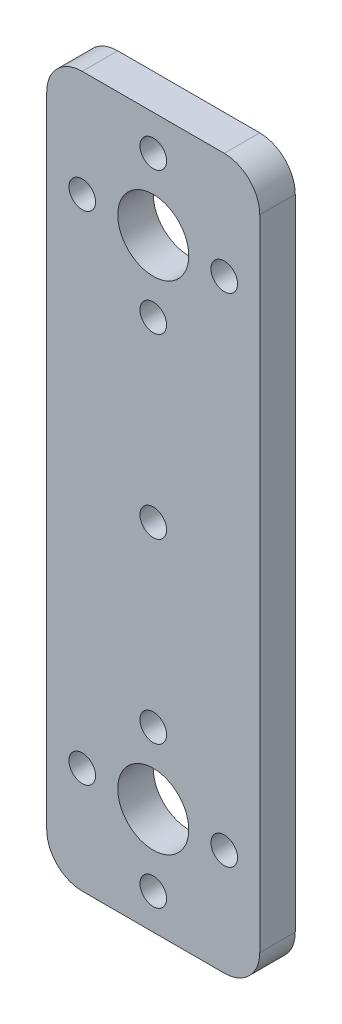
ISO-10303-21;
HEADER;
FILE_DESCRIPTION(('STEP AP214'),'2;1');
FILE_NAME('part.step','',(''),(''),'','','');
FILE_SCHEMA(('AUTOMOTIVE_DESIGN { 1 0 10303 214 1 1 1 1 }'));
ENDSEC;
DATA;
#1=APPLICATION_CONTEXT('core data for automotive mechanical design processes');
#2=APPLICATION_PROTOCOL_DEFINITION('international standard','automotive_design',2000,#1);
#3=PRODUCT_CONTEXT('',#1,'mechanical');
#4=PRODUCT('Part','Part','',(#3));
#5=PRODUCT_RELATED_PRODUCT_CATEGORY('part','',(#4));
#6=PRODUCT_DEFINITION_FORMATION('','',#4);
#7=PRODUCT_DEFINITION_CONTEXT('part definition',#1,'design');
#8=PRODUCT_DEFINITION('design','',#6,#7);
#9=PRODUCT_DEFINITION_SHAPE('','',#8);
#10=(LENGTH_UNIT() NAMED_UNIT(*) SI_UNIT(.MILLI.,.METRE.));
#11=(NAMED_UNIT(*) PLANE_ANGLE_UNIT() SI_UNIT($,.RADIAN.));
#12=(NAMED_UNIT(*) SI_UNIT($,.STERADIAN.) SOLID_ANGLE_UNIT());
#13=UNCERTAINTY_MEASURE_WITH_UNIT(LENGTH_MEASURE(1.E-05),#10,'distance_accuracy_value','');
#14=(GEOMETRIC_REPRESENTATION_CONTEXT(3) GLOBAL_UNCERTAINTY_ASSIGNED_CONTEXT((#13)) GLOBAL_UNIT_ASSIGNED_CONTEXT((#10,
#11,#12)) REPRESENTATION_CONTEXT('',''));
#15=CARTESIAN_POINT('',(0.,0.,0.));
#16=DIRECTION('',(0.,0.,1.));
#17=DIRECTION('',(1.,0.,0.));
#18=AXIS2_PLACEMENT_3D('',#15,#16,#17);
#19=CARTESIAN_POINT('',(-57.2966754660947,34.9503189792664,4.));
#20=DIRECTION('',(0.,1.,0.));
#21=DIRECTION('',(0.,0.,1.));
#22=AXIS2_PLACEMENT_3D('',#19,#20,#21);
#23=PLANE('',#22);
#24=DIRECTION('',(1.,0.,0.));
#25=VECTOR('',#24,1.);
#26=CARTESIAN_POINT('',(-57.2966754660947,34.9503189792664,0.));
#27=LINE('',#26,#25);
#28=CARTESIAN_POINT('',(-53.2966754660947,34.9503189792664,0.));
#29=VERTEX_POINT('',#28);
#30=CARTESIAN_POINT('',(-37.2966754660947,34.9503189792664,0.));
#31=VERTEX_POINT('',#30);
#32=EDGE_CURVE('E129',#29,#31,#27,.T.);
#33=ORIENTED_EDGE('',*,*,#32,.F.);
#34=DIRECTION('',(0.,0.,-1.));
#35=VECTOR('',#34,1.);
#36=CARTESIAN_POINT('',(-53.2966754660947,34.9503189792664,4.));
#37=LINE('',#36,#35);
#38=CARTESIAN_POINT('',(-53.2966754660947,34.9503189792664,4.));
#39=VERTEX_POINT('',#38);
#40=EDGE_CURVE('E11',#29,#39,#37,.F.);
#41=ORIENTED_EDGE('',*,*,#40,.T.);
#42=DIRECTION('',(1.,0.,0.));
#43=VECTOR('',#42,1.);
#44=CARTESIAN_POINT('',(-57.2966754660947,34.9503189792664,4.));
#45=LINE('',#44,#43);
#46=CARTESIAN_POINT('',(-37.2966754660947,34.9503189792664,4.));
#47=VERTEX_POINT('',#46);
#48=EDGE_CURVE('E127',#39,#47,#45,.T.);
#49=ORIENTED_EDGE('',*,*,#48,.T.);
#50=DIRECTION('',(0.,0.,-1.));
#51=VECTOR('',#50,1.);
#52=CARTESIAN_POINT('',(-37.2966754660947,34.9503189792664,4.));
#53=LINE('',#52,#51);
#54=EDGE_CURVE('E41',#47,#31,#53,.T.);
#55=ORIENTED_EDGE('',*,*,#54,.T.);
#56=EDGE_LOOP('',(#33,#41,#49,#55));
#57=FACE_BOUND('',#56,.T.);
#58=ADVANCED_FACE('F33',(#57),#23,.T.);
#59=CARTESIAN_POINT('',(-57.2966754660947,34.9503189792664,4.));
#60=DIRECTION('',(1.,0.,0.));
#61=DIRECTION('',(0.,1.,0.));
#62=AXIS2_PLACEMENT_3D('',#59,#60,#61);
#63=PLANE('',#62);
#64=DIRECTION('',(0.,-1.,0.));
#65=VECTOR('',#64,1.);
#66=CARTESIAN_POINT('',(-57.2966754660947,34.9503189792664,0.));
#67=LINE('',#66,#65);
#68=CARTESIAN_POINT('',(-57.2966754660947,30.9503189792664,0.));
#69=VERTEX_POINT('',#68);
#70=CARTESIAN_POINT('',(-57.2966754660947,-41.0496810207336,0.));
#71=VERTEX_POINT('',#70);
#72=EDGE_CURVE('E124',#69,#71,#67,.T.);
#73=ORIENTED_EDGE('',*,*,#72,.T.);
#74=DIRECTION('',(0.,0.,-1.));
#75=VECTOR('',#74,1.);
#76=CARTESIAN_POINT('',(-57.2966754660947,-41.0496810207336,4.));
#77=LINE('',#76,#75);
#78=CARTESIAN_POINT('',(-57.2966754660947,-41.0496810207336,4.));
#79=VERTEX_POINT('',#78);
#80=EDGE_CURVE('E104',#71,#79,#77,.F.);
#81=ORIENTED_EDGE('',*,*,#80,.T.);
#82=DIRECTION('',(0.,-1.,0.));
#83=VECTOR('',#82,1.);
#84=CARTESIAN_POINT('',(-57.2966754660947,34.9503189792664,4.));
#85=LINE('',#84,#83);
#86=CARTESIAN_POINT('',(-57.2966754660947,30.9503189792664,4.));
#87=VERTEX_POINT('',#86);
#88=EDGE_CURVE('E133',#87,#79,#85,.T.);
#89=ORIENTED_EDGE('',*,*,#88,.F.);
#90=DIRECTION('',(0.,0.,-1.));
#91=VECTOR('',#90,1.);
#92=CARTESIAN_POINT('',(-57.2966754660947,30.9503189792664,0.));
#93=LINE('',#92,#91);
#94=EDGE_CURVE('E109',#87,#69,#93,.T.);
#95=ORIENTED_EDGE('',*,*,#94,.T.);
#96=EDGE_LOOP('',(#73,#81,#89,#95));
#97=FACE_BOUND('',#96,.T.);
#98=ADVANCED_FACE('F272',(#97),#63,.F.);
#99=CARTESIAN_POINT('',(-57.2966754660947,-45.0496810207336,4.));
#100=DIRECTION('',(0.,1.,0.));
#101=DIRECTION('',(0.,0.,1.));
#102=AXIS2_PLACEMENT_3D('',#99,#100,#101);
#103=PLANE('',#102);
#104=DIRECTION('',(1.,0.,0.));
#105=VECTOR('',#104,1.);
#106=CARTESIAN_POINT('',(-57.2966754660947,-45.0496810207336,4.));
#107=LINE('',#106,#105);
#108=CARTESIAN_POINT('',(-53.2966754660947,-45.0496810207336,4.));
#109=VERTEX_POINT('',#108);
#110=CARTESIAN_POINT('',(-37.2966754660947,-45.0496810207336,4.));
#111=VERTEX_POINT('',#110);
#112=EDGE_CURVE('E118',#109,#111,#107,.T.);
#113=ORIENTED_EDGE('',*,*,#112,.F.);
#114=DIRECTION('',(0.,0.,-1.));
#115=VECTOR('',#114,1.);
#116=CARTESIAN_POINT('',(-53.2966754660947,-45.0496810207336,4.));
#117=LINE('',#116,#115);
#118=CARTESIAN_POINT('',(-53.2966754660947,-45.0496810207336,0.));
#119=VERTEX_POINT('',#118);
#120=EDGE_CURVE('E103',#109,#119,#117,.T.);
#121=ORIENTED_EDGE('',*,*,#120,.T.);
#122=DIRECTION('',(1.,0.,0.));
#123=VECTOR('',#122,1.);
#124=CARTESIAN_POINT('',(-57.2966754660947,-45.0496810207336,0.));
#125=LINE('',#124,#123);
#126=CARTESIAN_POINT('',(-37.2966754660947,-45.0496810207336,0.));
#127=VERTEX_POINT('',#126);
#128=EDGE_CURVE('E116',#119,#127,#125,.T.);
#129=ORIENTED_EDGE('',*,*,#128,.T.);
#130=DIRECTION('',(0.,0.,-1.));
#131=VECTOR('',#130,1.);
#132=CARTESIAN_POINT('',(-37.2966754660947,-45.0496810207336,4.));
#133=LINE('',#132,#131);
#134=EDGE_CURVE('E120',#127,#111,#133,.F.);
#135=ORIENTED_EDGE('',*,*,#134,.T.);
#136=EDGE_LOOP('',(#113,#121,#129,#135));
#137=FACE_BOUND('',#136,.T.);
#138=ADVANCED_FACE('F115',(#137),#103,.F.);
#139=CARTESIAN_POINT('',(-33.2966754660947,34.9503189792664,4.));
#140=DIRECTION('',(1.,0.,0.));
#141=DIRECTION('',(0.,1.,0.));
#142=AXIS2_PLACEMENT_3D('',#139,#140,#141);
#143=PLANE('',#142);
#144=DIRECTION('',(0.,-1.,0.));
#145=VECTOR('',#144,1.);
#146=CARTESIAN_POINT('',(-33.2966754660947,34.9503189792664,4.));
#147=LINE('',#146,#145);
#148=CARTESIAN_POINT('',(-33.2966754660947,30.9503189792664,4.));
#149=VERTEX_POINT('',#148);
#150=CARTESIAN_POINT('',(-33.2966754660947,-41.0496810207336,4.));
#151=VERTEX_POINT('',#150);
#152=EDGE_CURVE('E170',#149,#151,#147,.T.);
#153=ORIENTED_EDGE('',*,*,#152,.T.);
#154=DIRECTION('',(0.,0.,-1.));
#155=VECTOR('',#154,1.);
#156=CARTESIAN_POINT('',(-33.2966754660947,-41.0496810207336,0.));
#157=LINE('',#156,#155);
#158=CARTESIAN_POINT('',(-33.2966754660947,-41.0496810207336,0.));
#159=VERTEX_POINT('',#158);
#160=EDGE_CURVE('E150',#151,#159,#157,.T.);
#161=ORIENTED_EDGE('',*,*,#160,.T.);
#162=DIRECTION('',(0.,-1.,0.));
#163=VECTOR('',#162,1.);
#164=CARTESIAN_POINT('',(-33.2966754660947,34.9503189792664,0.));
#165=LINE('',#164,#163);
#166=CARTESIAN_POINT('',(-33.2966754660947,30.9503189792664,0.));
#167=VERTEX_POINT('',#166);
#168=EDGE_CURVE('E125',#167,#159,#165,.T.);
#169=ORIENTED_EDGE('',*,*,#168,.F.);
#170=DIRECTION('',(0.,0.,-1.));
#171=VECTOR('',#170,1.);
#172=CARTESIAN_POINT('',(-33.2966754660947,30.9503189792664,4.));
#173=LINE('',#172,#171);
#174=EDGE_CURVE('E55',#167,#149,#173,.F.);
#175=ORIENTED_EDGE('',*,*,#174,.T.);
#176=EDGE_LOOP('',(#153,#161,#169,#175));
#177=FACE_BOUND('',#176,.T.);
#178=ADVANCED_FACE('F247',(#177),#143,.T.);
#179=CARTESIAN_POINT('',(0.,0.,4.));
#180=DIRECTION('',(0.,0.,-1.));
#181=DIRECTION('',(-1.,0.,0.));
#182=AXIS2_PLACEMENT_3D('',#179,#180,#181);
#183=PLANE('',#182);
#184=CARTESIAN_POINT('',(-45.2966754660948,-5.04968102073364,4.));
#185=DIRECTION('',(0.,0.,1.));
#186=DIRECTION('',(1.,0.,0.));
#187=AXIS2_PLACEMENT_3D('',#184,#185,#186);
#188=CIRCLE('',#187,1.5);
#189=CARTESIAN_POINT('',(-43.7966754660948,-5.04968102073364,4.));
#190=VERTEX_POINT('',#189);
#191=EDGE_CURVE('E230',#190,#190,#188,.T.);
#192=ORIENTED_EDGE('',*,*,#191,.F.);
#193=EDGE_LOOP('',(#192));
#194=FACE_BOUND('',#193,.T.);
#195=CARTESIAN_POINT('',(-45.2966754660948,14.9503189792664,4.));
#196=DIRECTION('',(0.,0.,1.));
#197=DIRECTION('',(1.,0.,0.));
#198=AXIS2_PLACEMENT_3D('',#195,#196,#197);
#199=CIRCLE('',#198,1.5);
#200=CARTESIAN_POINT('',(-43.7966754660948,14.9503189792664,4.));
#201=VERTEX_POINT('',#200);
#202=EDGE_CURVE('E221',#201,#201,#199,.T.);
#203=ORIENTED_EDGE('',*,*,#202,.F.);
#204=EDGE_LOOP('',(#203));
#205=FACE_BOUND('',#204,.T.);
#206=CARTESIAN_POINT('',(-37.2966754660949,22.9503189792664,4.));
#207=DIRECTION('',(0.,0.,1.));
#208=DIRECTION('',(1.,0.,0.));
#209=AXIS2_PLACEMENT_3D('',#206,#207,#208);
#210=CIRCLE('',#209,1.5);
#211=CARTESIAN_POINT('',(-35.7966754660949,22.9503189792664,4.));
#212=VERTEX_POINT('',#211);
#213=EDGE_CURVE('E215',#212,#212,#210,.T.);
#214=ORIENTED_EDGE('',*,*,#213,.F.);
#215=EDGE_LOOP('',(#214));
#216=FACE_BOUND('',#215,.T.);
#217=CARTESIAN_POINT('',(-45.2966754660949,22.9503189792664,4.));
#218=DIRECTION('',(0.,0.,1.));
#219=DIRECTION('',(1.,0.,0.));
#220=AXIS2_PLACEMENT_3D('',#217,#218,#219);
#221=CIRCLE('',#220,4.);
#222=CARTESIAN_POINT('',(-41.2966754660949,22.9503189792664,4.));
#223=VERTEX_POINT('',#222);
#224=EDGE_CURVE('E209',#223,#223,#221,.T.);
#225=ORIENTED_EDGE('',*,*,#224,.F.);
#226=EDGE_LOOP('',(#225));
#227=FACE_BOUND('',#226,.T.);
#228=CARTESIAN_POINT('',(-45.2966754660949,30.9503189792664,4.));
#229=DIRECTION('',(0.,0.,1.));
#230=DIRECTION('',(1.,0.,0.));
#231=AXIS2_PLACEMENT_3D('',#228,#229,#230);
#232=CIRCLE('',#231,1.5);
#233=CARTESIAN_POINT('',(-43.7966754660949,30.9503189792664,4.));
#234=VERTEX_POINT('',#233);
#235=EDGE_CURVE('E203',#234,#234,#232,.T.);
#236=ORIENTED_EDGE('',*,*,#235,.F.);
#237=EDGE_LOOP('',(#236));
#238=FACE_BOUND('',#237,.T.);
#239=CARTESIAN_POINT('',(-53.2966754660949,22.9503189792664,4.));
#240=DIRECTION('',(0.,0.,1.));
#241=DIRECTION('',(1.,0.,0.));
#242=AXIS2_PLACEMENT_3D('',#239,#240,#241);
#243=CIRCLE('',#242,1.5);
#244=CARTESIAN_POINT('',(-51.7966754660949,22.9503189792664,4.));
#245=VERTEX_POINT('',#244);
#246=EDGE_CURVE('E197',#245,#245,#243,.T.);
#247=ORIENTED_EDGE('',*,*,#246,.F.);
#248=EDGE_LOOP('',(#247));
#249=FACE_BOUND('',#248,.T.);
#250=CARTESIAN_POINT('',(-53.2966754660947,-33.0496810207337,4.));
#251=DIRECTION('',(0.,0.,1.));
#252=DIRECTION('',(1.,0.,0.));
#253=AXIS2_PLACEMENT_3D('',#250,#251,#252);
#254=CIRCLE('',#253,1.5);
#255=CARTESIAN_POINT('',(-51.7966754660947,-33.0496810207337,4.));
#256=VERTEX_POINT('',#255);
#257=EDGE_CURVE('E191',#256,#256,#254,.T.);
#258=ORIENTED_EDGE('',*,*,#257,.F.);
#259=EDGE_LOOP('',(#258));
#260=FACE_BOUND('',#259,.T.);
#261=CARTESIAN_POINT('',(-45.2966754660947,-41.0496810207336,4.));
#262=DIRECTION('',(0.,0.,1.));
#263=DIRECTION('',(1.,0.,0.));
#264=AXIS2_PLACEMENT_3D('',#261,#262,#263);
#265=CIRCLE('',#264,1.5);
#266=CARTESIAN_POINT('',(-43.7966754660947,-41.0496810207336,4.));
#267=VERTEX_POINT('',#266);
#268=EDGE_CURVE('E185',#267,#267,#265,.T.);
#269=ORIENTED_EDGE('',*,*,#268,.F.);
#270=EDGE_LOOP('',(#269));
#271=FACE_BOUND('',#270,.T.);
#272=CARTESIAN_POINT('',(-37.2966754660947,-33.0496810207336,4.));
#273=DIRECTION('',(0.,0.,1.));
#274=DIRECTION('',(1.,0.,0.));
#275=AXIS2_PLACEMENT_3D('',#272,#273,#274);
#276=CIRCLE('',#275,1.5);
#277=CARTESIAN_POINT('',(-35.7966754660947,-33.0496810207336,4.));
#278=VERTEX_POINT('',#277);
#279=EDGE_CURVE('E179',#278,#278,#276,.T.);
#280=ORIENTED_EDGE('',*,*,#279,.F.);
#281=EDGE_LOOP('',(#280));
#282=FACE_BOUND('',#281,.T.);
#283=CARTESIAN_POINT('',(-45.2966754660947,-33.0496810207336,4.));
#284=DIRECTION('',(0.,0.,1.));
#285=DIRECTION('',(1.,0.,0.));
#286=AXIS2_PLACEMENT_3D('',#283,#284,#285);
#287=CIRCLE('',#286,4.);
#288=CARTESIAN_POINT('',(-41.2966754660947,-33.0496810207336,4.));
#289=VERTEX_POINT('',#288);
#290=EDGE_CURVE('E174',#289,#289,#287,.T.);
#291=ORIENTED_EDGE('',*,*,#290,.F.);
#292=EDGE_LOOP('',(#291));
#293=FACE_BOUND('',#292,.T.);
#294=CARTESIAN_POINT('',(-45.2966754660947,-25.0496810207336,4.));
#295=DIRECTION('',(0.,0.,1.));
#296=DIRECTION('',(1.,0.,0.));
#297=AXIS2_PLACEMENT_3D('',#294,#295,#296);
#298=CIRCLE('',#297,1.5);
#299=CARTESIAN_POINT('',(-43.7966754660947,-25.0496810207336,4.));
#300=VERTEX_POINT('',#299);
#301=EDGE_CURVE('E164',#300,#300,#298,.T.);
#302=ORIENTED_EDGE('',*,*,#301,.F.);
#303=EDGE_LOOP('',(#302));
#304=FACE_BOUND('',#303,.T.);
#305=ORIENTED_EDGE('',*,*,#88,.T.);
#306=CARTESIAN_POINT('',(-53.2966754660947,-41.0496810207336,4.));
#307=DIRECTION('',(0.,0.,-1.));
#308=DIRECTION('',(-1.,0.,0.));
#309=AXIS2_PLACEMENT_3D('',#306,#307,#308);
#310=CIRCLE('',#309,4.);
#311=EDGE_CURVE('E147',#79,#109,#310,.F.);
#312=ORIENTED_EDGE('',*,*,#311,.T.);
#313=ORIENTED_EDGE('',*,*,#112,.T.);
#314=CARTESIAN_POINT('',(-37.2966754660947,-41.0496810207336,4.));
#315=DIRECTION('',(0.,0.,-1.));
#316=DIRECTION('',(-1.,0.,0.));
#317=AXIS2_PLACEMENT_3D('',#314,#315,#316);
#318=CIRCLE('',#317,4.);
#319=EDGE_CURVE('E48',#111,#151,#318,.F.);
#320=ORIENTED_EDGE('',*,*,#319,.T.);
#321=ORIENTED_EDGE('',*,*,#152,.F.);
#322=CARTESIAN_POINT('',(-37.2966754660947,30.9503189792664,4.));
#323=DIRECTION('',(0.,0.,-1.));
#324=DIRECTION('',(-1.,0.,0.));
#325=AXIS2_PLACEMENT_3D('',#322,#323,#324);
#326=CIRCLE('',#325,4.);
#327=EDGE_CURVE('E142',#149,#47,#326,.F.);
#328=ORIENTED_EDGE('',*,*,#327,.T.);
#329=ORIENTED_EDGE('',*,*,#48,.F.);
#330=CARTESIAN_POINT('',(-53.2966754660947,30.9503189792664,4.));
#331=DIRECTION('',(0.,0.,-1.));
#332=DIRECTION('',(-1.,0.,0.));
#333=AXIS2_PLACEMENT_3D('',#330,#331,#332);
#334=CIRCLE('',#333,4.);
#335=EDGE_CURVE('E144',#39,#87,#334,.F.);
#336=ORIENTED_EDGE('',*,*,#335,.T.);
#337=EDGE_LOOP('',(#305,#312,#313,#320,#321,#328,#329,#336));
#338=FACE_BOUND('',#337,.T.);
#339=ADVANCED_FACE('F244',(#194,#205,#216,#227,#238,#249,#260,#271,#282,#293,#304,#338),#183,.F.);
#340=CARTESIAN_POINT('',(0.,0.,0.));
#341=DIRECTION('',(0.,0.,-1.));
#342=DIRECTION('',(-1.,0.,0.));
#343=AXIS2_PLACEMENT_3D('',#340,#341,#342);
#344=PLANE('',#343);
#345=CARTESIAN_POINT('',(-45.2966754660948,-5.04968102073364,0.));
#346=DIRECTION('',(0.,0.,1.));
#347=DIRECTION('',(1.,0.,0.));
#348=AXIS2_PLACEMENT_3D('',#345,#346,#347);
#349=CIRCLE('',#348,1.5);
#350=CARTESIAN_POINT('',(-43.7966754660948,-5.04968102073364,0.));
#351=VERTEX_POINT('',#350);
#352=EDGE_CURVE('E227',#351,#351,#349,.T.);
#353=ORIENTED_EDGE('',*,*,#352,.T.);
#354=EDGE_LOOP('',(#353));
#355=FACE_BOUND('',#354,.T.);
#356=CARTESIAN_POINT('',(-45.2966754660948,14.9503189792664,0.));
#357=DIRECTION('',(0.,0.,1.));
#358=DIRECTION('',(1.,0.,0.));
#359=AXIS2_PLACEMENT_3D('',#356,#357,#358);
#360=CIRCLE('',#359,1.5);
#361=CARTESIAN_POINT('',(-43.7966754660948,14.9503189792664,0.));
#362=VERTEX_POINT('',#361);
#363=EDGE_CURVE('E224',#362,#362,#360,.T.);
#364=ORIENTED_EDGE('',*,*,#363,.T.);
#365=EDGE_LOOP('',(#364));
#366=FACE_BOUND('',#365,.T.);
#367=CARTESIAN_POINT('',(-37.2966754660949,22.9503189792664,0.));
#368=DIRECTION('',(0.,0.,1.));
#369=DIRECTION('',(1.,0.,0.));
#370=AXIS2_PLACEMENT_3D('',#367,#368,#369);
#371=CIRCLE('',#370,1.5);
#372=CARTESIAN_POINT('',(-35.7966754660949,22.9503189792664,0.));
#373=VERTEX_POINT('',#372);
#374=EDGE_CURVE('E218',#373,#373,#371,.T.);
#375=ORIENTED_EDGE('',*,*,#374,.T.);
#376=EDGE_LOOP('',(#375));
#377=FACE_BOUND('',#376,.T.);
#378=CARTESIAN_POINT('',(-45.2966754660949,22.9503189792664,0.));
#379=DIRECTION('',(0.,0.,1.));
#380=DIRECTION('',(1.,0.,0.));
#381=AXIS2_PLACEMENT_3D('',#378,#379,#380);
#382=CIRCLE('',#381,4.);
#383=CARTESIAN_POINT('',(-41.2966754660949,22.9503189792664,0.));
#384=VERTEX_POINT('',#383);
#385=EDGE_CURVE('E212',#384,#384,#382,.T.);
#386=ORIENTED_EDGE('',*,*,#385,.T.);
#387=EDGE_LOOP('',(#386));
#388=FACE_BOUND('',#387,.T.);
#389=CARTESIAN_POINT('',(-45.2966754660949,30.9503189792664,0.));
#390=DIRECTION('',(0.,0.,1.));
#391=DIRECTION('',(1.,0.,0.));
#392=AXIS2_PLACEMENT_3D('',#389,#390,#391);
#393=CIRCLE('',#392,1.5);
#394=CARTESIAN_POINT('',(-43.7966754660949,30.9503189792664,0.));
#395=VERTEX_POINT('',#394);
#396=EDGE_CURVE('E206',#395,#395,#393,.T.);
#397=ORIENTED_EDGE('',*,*,#396,.T.);
#398=EDGE_LOOP('',(#397));
#399=FACE_BOUND('',#398,.T.);
#400=CARTESIAN_POINT('',(-53.2966754660949,22.9503189792664,0.));
#401=DIRECTION('',(0.,0.,1.));
#402=DIRECTION('',(1.,0.,0.));
#403=AXIS2_PLACEMENT_3D('',#400,#401,#402);
#404=CIRCLE('',#403,1.5);
#405=CARTESIAN_POINT('',(-51.7966754660949,22.9503189792664,0.));
#406=VERTEX_POINT('',#405);
#407=EDGE_CURVE('E200',#406,#406,#404,.T.);
#408=ORIENTED_EDGE('',*,*,#407,.T.);
#409=EDGE_LOOP('',(#408));
#410=FACE_BOUND('',#409,.T.);
#411=CARTESIAN_POINT('',(-53.2966754660947,-33.0496810207337,0.));
#412=DIRECTION('',(0.,0.,1.));
#413=DIRECTION('',(1.,0.,0.));
#414=AXIS2_PLACEMENT_3D('',#411,#412,#413);
#415=CIRCLE('',#414,1.5);
#416=CARTESIAN_POINT('',(-51.7966754660947,-33.0496810207337,0.));
#417=VERTEX_POINT('',#416);
#418=EDGE_CURVE('E194',#417,#417,#415,.T.);
#419=ORIENTED_EDGE('',*,*,#418,.T.);
#420=EDGE_LOOP('',(#419));
#421=FACE_BOUND('',#420,.T.);
#422=CARTESIAN_POINT('',(-45.2966754660947,-41.0496810207336,0.));
#423=DIRECTION('',(0.,0.,1.));
#424=DIRECTION('',(1.,0.,0.));
#425=AXIS2_PLACEMENT_3D('',#422,#423,#424);
#426=CIRCLE('',#425,1.5);
#427=CARTESIAN_POINT('',(-43.7966754660947,-41.0496810207336,0.));
#428=VERTEX_POINT('',#427);
#429=EDGE_CURVE('E188',#428,#428,#426,.T.);
#430=ORIENTED_EDGE('',*,*,#429,.T.);
#431=EDGE_LOOP('',(#430));
#432=FACE_BOUND('',#431,.T.);
#433=CARTESIAN_POINT('',(-37.2966754660947,-33.0496810207336,0.));
#434=DIRECTION('',(0.,0.,1.));
#435=DIRECTION('',(1.,0.,0.));
#436=AXIS2_PLACEMENT_3D('',#433,#434,#435);
#437=CIRCLE('',#436,1.5);
#438=CARTESIAN_POINT('',(-35.7966754660947,-33.0496810207336,0.));
#439=VERTEX_POINT('',#438);
#440=EDGE_CURVE('E182',#439,#439,#437,.T.);
#441=ORIENTED_EDGE('',*,*,#440,.T.);
#442=EDGE_LOOP('',(#441));
#443=FACE_BOUND('',#442,.T.);
#444=CARTESIAN_POINT('',(-45.2966754660947,-33.0496810207336,0.));
#445=DIRECTION('',(0.,0.,1.));
#446=DIRECTION('',(1.,0.,0.));
#447=AXIS2_PLACEMENT_3D('',#444,#445,#446);
#448=CIRCLE('',#447,4.);
#449=CARTESIAN_POINT('',(-41.2966754660947,-33.0496810207336,0.));
#450=VERTEX_POINT('',#449);
#451=EDGE_CURVE('E176',#450,#450,#448,.T.);
#452=ORIENTED_EDGE('',*,*,#451,.T.);
#453=EDGE_LOOP('',(#452));
#454=FACE_BOUND('',#453,.T.);
#455=CARTESIAN_POINT('',(-45.2966754660947,-25.0496810207336,0.));
#456=DIRECTION('',(0.,0.,1.));
#457=DIRECTION('',(1.,0.,0.));
#458=AXIS2_PLACEMENT_3D('',#455,#456,#457);
#459=CIRCLE('',#458,1.5);
#460=CARTESIAN_POINT('',(-43.7966754660947,-25.0496810207336,0.));
#461=VERTEX_POINT('',#460);
#462=EDGE_CURVE('E162',#461,#461,#459,.T.);
#463=ORIENTED_EDGE('',*,*,#462,.T.);
#464=EDGE_LOOP('',(#463));
#465=FACE_BOUND('',#464,.T.);
#466=ORIENTED_EDGE('',*,*,#128,.F.);
#467=CARTESIAN_POINT('',(-53.2966754660947,-41.0496810207336,0.));
#468=DIRECTION('',(0.,0.,-1.));
#469=DIRECTION('',(-1.,0.,0.));
#470=AXIS2_PLACEMENT_3D('',#467,#468,#469);
#471=CIRCLE('',#470,4.);
#472=EDGE_CURVE('E99',#119,#71,#471,.T.);
#473=ORIENTED_EDGE('',*,*,#472,.T.);
#474=ORIENTED_EDGE('',*,*,#72,.F.);
#475=CARTESIAN_POINT('',(-53.2966754660947,30.9503189792664,0.));
#476=DIRECTION('',(0.,0.,-1.));
#477=DIRECTION('',(-1.,0.,0.));
#478=AXIS2_PLACEMENT_3D('',#475,#476,#477);
#479=CIRCLE('',#478,4.);
#480=EDGE_CURVE('E136',#69,#29,#479,.T.);
#481=ORIENTED_EDGE('',*,*,#480,.T.);
#482=ORIENTED_EDGE('',*,*,#32,.T.);
#483=CARTESIAN_POINT('',(-37.2966754660947,30.9503189792664,0.));
#484=DIRECTION('',(0.,0.,-1.));
#485=DIRECTION('',(-1.,0.,0.));
#486=AXIS2_PLACEMENT_3D('',#483,#484,#485);
#487=CIRCLE('',#486,4.);
#488=EDGE_CURVE('E119',#31,#167,#487,.T.);
#489=ORIENTED_EDGE('',*,*,#488,.T.);
#490=ORIENTED_EDGE('',*,*,#168,.T.);
#491=CARTESIAN_POINT('',(-37.2966754660947,-41.0496810207336,0.));
#492=DIRECTION('',(0.,0.,-1.));
#493=DIRECTION('',(-1.,0.,0.));
#494=AXIS2_PLACEMENT_3D('',#491,#492,#493);
#495=CIRCLE('',#494,4.);
#496=EDGE_CURVE('E110',#159,#127,#495,.T.);
#497=ORIENTED_EDGE('',*,*,#496,.T.);
#498=EDGE_LOOP('',(#466,#473,#474,#481,#482,#489,#490,#497));
#499=FACE_BOUND('',#498,.T.);
#500=ADVANCED_FACE('F122',(#355,#366,#377,#388,#399,#410,#421,#432,#443,#454,#465,#499),#344,.T.);
#501=CARTESIAN_POINT('',(-45.2966754660947,-25.0496810207336,0.));
#502=DIRECTION('',(0.,0.,1.));
#503=DIRECTION('',(1.,0.,0.));
#504=AXIS2_PLACEMENT_3D('',#501,#502,#503);
#505=CYLINDRICAL_SURFACE('',#504,1.5);
#506=ORIENTED_EDGE('',*,*,#462,.F.);
#507=EDGE_LOOP('',(#506));
#508=FACE_BOUND('',#507,.T.);
#509=ORIENTED_EDGE('',*,*,#301,.T.);
#510=EDGE_LOOP('',(#509));
#511=FACE_BOUND('',#510,.T.);
#512=ADVANCED_FACE('F306',(#508,#511),#505,.F.);
#513=CARTESIAN_POINT('',(-45.2966754660947,-33.0496810207336,0.));
#514=DIRECTION('',(0.,0.,1.));
#515=DIRECTION('',(1.,0.,0.));
#516=AXIS2_PLACEMENT_3D('',#513,#514,#515);
#517=CYLINDRICAL_SURFACE('',#516,4.);
#518=ORIENTED_EDGE('',*,*,#451,.F.);
#519=EDGE_LOOP('',(#518));
#520=FACE_BOUND('',#519,.T.);
#521=ORIENTED_EDGE('',*,*,#290,.T.);
#522=EDGE_LOOP('',(#521));
#523=FACE_BOUND('',#522,.T.);
#524=ADVANCED_FACE('F310',(#520,#523),#517,.F.);
#525=CARTESIAN_POINT('',(-37.2966754660947,-33.0496810207336,0.));
#526=DIRECTION('',(0.,0.,1.));
#527=DIRECTION('',(1.,0.,0.));
#528=AXIS2_PLACEMENT_3D('',#525,#526,#527);
#529=CYLINDRICAL_SURFACE('',#528,1.5);
#530=ORIENTED_EDGE('',*,*,#440,.F.);
#531=EDGE_LOOP('',(#530));
#532=FACE_BOUND('',#531,.T.);
#533=ORIENTED_EDGE('',*,*,#279,.T.);
#534=EDGE_LOOP('',(#533));
#535=FACE_BOUND('',#534,.T.);
#536=ADVANCED_FACE('F314',(#532,#535),#529,.F.);
#537=CARTESIAN_POINT('',(-45.2966754660947,-41.0496810207336,0.));
#538=DIRECTION('',(0.,0.,1.));
#539=DIRECTION('',(1.,0.,0.));
#540=AXIS2_PLACEMENT_3D('',#537,#538,#539);
#541=CYLINDRICAL_SURFACE('',#540,1.5);
#542=ORIENTED_EDGE('',*,*,#429,.F.);
#543=EDGE_LOOP('',(#542));
#544=FACE_BOUND('',#543,.T.);
#545=ORIENTED_EDGE('',*,*,#268,.T.);
#546=EDGE_LOOP('',(#545));
#547=FACE_BOUND('',#546,.T.);
#548=ADVANCED_FACE('F318',(#544,#547),#541,.F.);
#549=CARTESIAN_POINT('',(-53.2966754660947,-33.0496810207337,0.));
#550=DIRECTION('',(0.,0.,1.));
#551=DIRECTION('',(1.,0.,0.));
#552=AXIS2_PLACEMENT_3D('',#549,#550,#551);
#553=CYLINDRICAL_SURFACE('',#552,1.5);
#554=ORIENTED_EDGE('',*,*,#418,.F.);
#555=EDGE_LOOP('',(#554));
#556=FACE_BOUND('',#555,.T.);
#557=ORIENTED_EDGE('',*,*,#257,.T.);
#558=EDGE_LOOP('',(#557));
#559=FACE_BOUND('',#558,.T.);
#560=ADVANCED_FACE('F322',(#556,#559),#553,.F.);
#561=CARTESIAN_POINT('',(-53.2966754660949,22.9503189792664,0.));
#562=DIRECTION('',(0.,0.,1.));
#563=DIRECTION('',(1.,0.,0.));
#564=AXIS2_PLACEMENT_3D('',#561,#562,#563);
#565=CYLINDRICAL_SURFACE('',#564,1.5);
#566=ORIENTED_EDGE('',*,*,#407,.F.);
#567=EDGE_LOOP('',(#566));
#568=FACE_BOUND('',#567,.T.);
#569=ORIENTED_EDGE('',*,*,#246,.T.);
#570=EDGE_LOOP('',(#569));
#571=FACE_BOUND('',#570,.T.);
#572=ADVANCED_FACE('F326',(#568,#571),#565,.F.);
#573=CARTESIAN_POINT('',(-45.2966754660949,30.9503189792664,0.));
#574=DIRECTION('',(0.,0.,1.));
#575=DIRECTION('',(1.,0.,0.));
#576=AXIS2_PLACEMENT_3D('',#573,#574,#575);
#577=CYLINDRICAL_SURFACE('',#576,1.5);
#578=ORIENTED_EDGE('',*,*,#396,.F.);
#579=EDGE_LOOP('',(#578));
#580=FACE_BOUND('',#579,.T.);
#581=ORIENTED_EDGE('',*,*,#235,.T.);
#582=EDGE_LOOP('',(#581));
#583=FACE_BOUND('',#582,.T.);
#584=ADVANCED_FACE('F330',(#580,#583),#577,.F.);
#585=CARTESIAN_POINT('',(-45.2966754660949,22.9503189792664,0.));
#586=DIRECTION('',(0.,0.,1.));
#587=DIRECTION('',(1.,0.,0.));
#588=AXIS2_PLACEMENT_3D('',#585,#586,#587);
#589=CYLINDRICAL_SURFACE('',#588,4.);
#590=ORIENTED_EDGE('',*,*,#385,.F.);
#591=EDGE_LOOP('',(#590));
#592=FACE_BOUND('',#591,.T.);
#593=ORIENTED_EDGE('',*,*,#224,.T.);
#594=EDGE_LOOP('',(#593));
#595=FACE_BOUND('',#594,.T.);
#596=ADVANCED_FACE('F334',(#592,#595),#589,.F.);
#597=CARTESIAN_POINT('',(-37.2966754660949,22.9503189792664,0.));
#598=DIRECTION('',(0.,0.,1.));
#599=DIRECTION('',(1.,0.,0.));
#600=AXIS2_PLACEMENT_3D('',#597,#598,#599);
#601=CYLINDRICAL_SURFACE('',#600,1.5);
#602=ORIENTED_EDGE('',*,*,#374,.F.);
#603=EDGE_LOOP('',(#602));
#604=FACE_BOUND('',#603,.T.);
#605=ORIENTED_EDGE('',*,*,#213,.T.);
#606=EDGE_LOOP('',(#605));
#607=FACE_BOUND('',#606,.T.);
#608=ADVANCED_FACE('F338',(#604,#607),#601,.F.);
#609=CARTESIAN_POINT('',(-45.2966754660948,14.9503189792664,0.));
#610=DIRECTION('',(0.,0.,1.));
#611=DIRECTION('',(1.,0.,0.));
#612=AXIS2_PLACEMENT_3D('',#609,#610,#611);
#613=CYLINDRICAL_SURFACE('',#612,1.5);
#614=ORIENTED_EDGE('',*,*,#363,.F.);
#615=EDGE_LOOP('',(#614));
#616=FACE_BOUND('',#615,.T.);
#617=ORIENTED_EDGE('',*,*,#202,.T.);
#618=EDGE_LOOP('',(#617));
#619=FACE_BOUND('',#618,.T.);
#620=ADVANCED_FACE('F291',(#616,#619),#613,.F.);
#621=CARTESIAN_POINT('',(-53.2966754660947,-41.0496810207336,4.));
#622=DIRECTION('',(0.,0.,-1.));
#623=DIRECTION('',(-1.,0.,0.));
#624=AXIS2_PLACEMENT_3D('',#621,#622,#623);
#625=CYLINDRICAL_SURFACE('',#624,4.);
#626=ORIENTED_EDGE('',*,*,#311,.F.);
#627=ORIENTED_EDGE('',*,*,#80,.F.);
#628=ORIENTED_EDGE('',*,*,#472,.F.);
#629=ORIENTED_EDGE('',*,*,#120,.F.);
#630=EDGE_LOOP('',(#626,#627,#628,#629));
#631=FACE_BOUND('',#630,.T.);
#632=ADVANCED_FACE('F102',(#631),#625,.T.);
#633=CARTESIAN_POINT('',(-37.2966754660947,-41.0496810207336,4.));
#634=DIRECTION('',(0.,0.,1.));
#635=DIRECTION('',(1.,0.,0.));
#636=AXIS2_PLACEMENT_3D('',#633,#634,#635);
#637=CYLINDRICAL_SURFACE('',#636,4.);
#638=ORIENTED_EDGE('',*,*,#319,.F.);
#639=ORIENTED_EDGE('',*,*,#134,.F.);
#640=ORIENTED_EDGE('',*,*,#496,.F.);
#641=ORIENTED_EDGE('',*,*,#160,.F.);
#642=EDGE_LOOP('',(#638,#639,#640,#641));
#643=FACE_BOUND('',#642,.T.);
#644=ADVANCED_FACE('F279',(#643),#637,.T.);
#645=CARTESIAN_POINT('',(-53.2966754660947,30.9503189792664,4.));
#646=DIRECTION('',(0.,0.,1.));
#647=DIRECTION('',(1.,0.,0.));
#648=AXIS2_PLACEMENT_3D('',#645,#646,#647);
#649=CYLINDRICAL_SURFACE('',#648,4.);
#650=ORIENTED_EDGE('',*,*,#335,.F.);
#651=ORIENTED_EDGE('',*,*,#40,.F.);
#652=ORIENTED_EDGE('',*,*,#480,.F.);
#653=ORIENTED_EDGE('',*,*,#94,.F.);
#654=EDGE_LOOP('',(#650,#651,#652,#653));
#655=FACE_BOUND('',#654,.T.);
#656=ADVANCED_FACE('F274',(#655),#649,.T.);
#657=CARTESIAN_POINT('',(-37.2966754660947,30.9503189792664,4.));
#658=DIRECTION('',(0.,0.,-1.));
#659=DIRECTION('',(-1.,0.,0.));
#660=AXIS2_PLACEMENT_3D('',#657,#658,#659);
#661=CYLINDRICAL_SURFACE('',#660,4.);
#662=ORIENTED_EDGE('',*,*,#327,.F.);
#663=ORIENTED_EDGE('',*,*,#174,.F.);
#664=ORIENTED_EDGE('',*,*,#488,.F.);
#665=ORIENTED_EDGE('',*,*,#54,.F.);
#666=EDGE_LOOP('',(#662,#663,#664,#665));
#667=FACE_BOUND('',#666,.T.);
#668=ADVANCED_FACE('F35',(#667),#661,.T.);
#669=CARTESIAN_POINT('',(-45.2966754660948,-5.04968102073364,0.));
#670=DIRECTION('',(0.,0.,1.));
#671=DIRECTION('',(1.,0.,0.));
#672=AXIS2_PLACEMENT_3D('',#669,#670,#671);
#673=CYLINDRICAL_SURFACE('',#672,1.5);
#674=ORIENTED_EDGE('',*,*,#352,.F.);
#675=EDGE_LOOP('',(#674));
#676=FACE_BOUND('',#675,.T.);
#677=ORIENTED_EDGE('',*,*,#191,.T.);
#678=EDGE_LOOP('',(#677));
#679=FACE_BOUND('',#678,.T.);
#680=ADVANCED_FACE('F238',(#676,#679),#673,.F.);
#681=CLOSED_SHELL('',(#58,#98,#138,#178,#339,#500,#512,#524,#536,#548,#560,#572,#584,#596,#608,
#620,#632,#644,#656,#668,#680));
#682=MANIFOLD_SOLID_BREP('B2',#681);
#683=ADVANCED_BREP_SHAPE_REPRESENTATION('',(#18,#682),#14);
#684=SHAPE_DEFINITION_REPRESENTATION(#9,#683);
ENDSEC;
END-ISO-10303-21;
